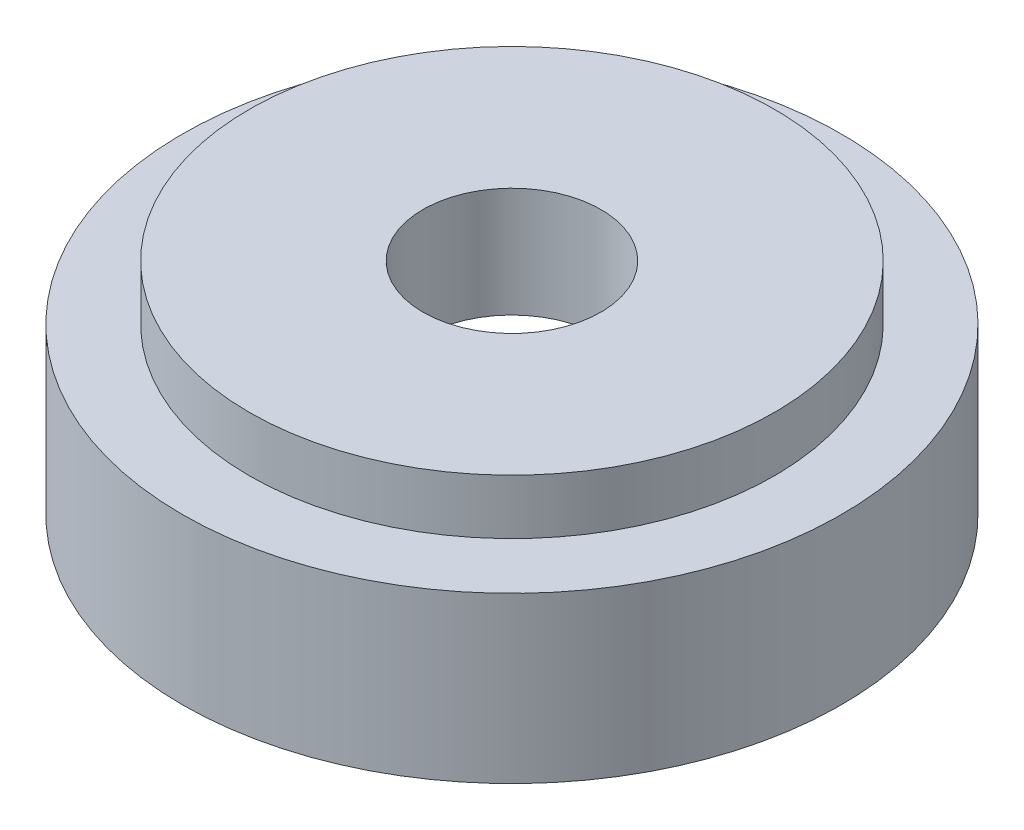
ISO-10303-21;
HEADER;
FILE_DESCRIPTION(('STEP AP214'),'2;1');
FILE_NAME('part.step','',(''),(''),'','','');
FILE_SCHEMA(('AUTOMOTIVE_DESIGN { 1 0 10303 214 1 1 1 1 }'));
ENDSEC;
DATA;
#1=APPLICATION_CONTEXT('core data for automotive mechanical design processes');
#2=APPLICATION_PROTOCOL_DEFINITION('international standard','automotive_design',2000,#1);
#3=PRODUCT_CONTEXT('',#1,'mechanical');
#4=PRODUCT('Part','Part','',(#3));
#5=PRODUCT_RELATED_PRODUCT_CATEGORY('part','',(#4));
#6=PRODUCT_DEFINITION_FORMATION('','',#4);
#7=PRODUCT_DEFINITION_CONTEXT('part definition',#1,'design');
#8=PRODUCT_DEFINITION('design','',#6,#7);
#9=PRODUCT_DEFINITION_SHAPE('','',#8);
#10=(LENGTH_UNIT() NAMED_UNIT(*) SI_UNIT(.MILLI.,.METRE.));
#11=(NAMED_UNIT(*) PLANE_ANGLE_UNIT() SI_UNIT($,.RADIAN.));
#12=(NAMED_UNIT(*) SI_UNIT($,.STERADIAN.) SOLID_ANGLE_UNIT());
#13=UNCERTAINTY_MEASURE_WITH_UNIT(LENGTH_MEASURE(1.E-05),#10,'distance_accuracy_value','');
#14=(GEOMETRIC_REPRESENTATION_CONTEXT(3) GLOBAL_UNCERTAINTY_ASSIGNED_CONTEXT((#13)) GLOBAL_UNIT_ASSIGNED_CONTEXT((#10,
#11,#12)) REPRESENTATION_CONTEXT('',''));
#15=CARTESIAN_POINT('',(0.,0.,0.));
#16=DIRECTION('',(0.,0.,1.));
#17=DIRECTION('',(1.,0.,0.));
#18=AXIS2_PLACEMENT_3D('',#15,#16,#17);
#19=CARTESIAN_POINT('',(0.,-5.,0.));
#20=DIRECTION('',(0.,1.,0.));
#21=DIRECTION('',(0.,0.,1.));
#22=AXIS2_PLACEMENT_3D('',#19,#20,#21);
#23=PLANE('',#22);
#24=CARTESIAN_POINT('',(0.,-5.,0.));
#25=DIRECTION('',(0.,1.,0.));
#26=DIRECTION('',(0.,0.,1.));
#27=AXIS2_PLACEMENT_3D('',#24,#25,#26);
#28=CIRCLE('',#27,8.1);
#29=CARTESIAN_POINT('',(0.,-5.,8.1));
#30=VERTEX_POINT('',#29);
#31=EDGE_CURVE('E59',#30,#30,#28,.T.);
#32=ORIENTED_EDGE('',*,*,#31,.T.);
#33=EDGE_LOOP('',(#32));
#34=FACE_BOUND('',#33,.T.);
#35=CARTESIAN_POINT('',(0.,-5.,0.));
#36=DIRECTION('',(0.,1.,0.));
#37=DIRECTION('',(0.,0.,1.));
#38=AXIS2_PLACEMENT_3D('',#35,#36,#37);
#39=CIRCLE('',#38,23.9);
#40=CARTESIAN_POINT('',(0.,-5.,23.9));
#41=VERTEX_POINT('',#40);
#42=EDGE_CURVE('E10',#41,#41,#39,.T.);
#43=ORIENTED_EDGE('',*,*,#42,.F.);
#44=EDGE_LOOP('',(#43));
#45=FACE_BOUND('',#44,.T.);
#46=ADVANCED_FACE('F41',(#34,#45),#23,.F.);
#47=CARTESIAN_POINT('',(0.,5.,0.));
#48=DIRECTION('',(0.,-1.,0.));
#49=DIRECTION('',(0.,0.,-1.));
#50=AXIS2_PLACEMENT_3D('',#47,#48,#49);
#51=CYLINDRICAL_SURFACE('',#50,8.1);
#52=CARTESIAN_POINT('',(0.,5.,0.));
#53=DIRECTION('',(0.,1.,0.));
#54=DIRECTION('',(0.,0.,1.));
#55=AXIS2_PLACEMENT_3D('',#52,#53,#54);
#56=CIRCLE('',#55,8.1);
#57=CARTESIAN_POINT('',(0.,5.,8.1));
#58=VERTEX_POINT('',#57);
#59=EDGE_CURVE('E54',#58,#58,#56,.T.);
#60=ORIENTED_EDGE('',*,*,#59,.T.);
#61=EDGE_LOOP('',(#60));
#62=FACE_BOUND('',#61,.T.);
#63=ORIENTED_EDGE('',*,*,#31,.F.);
#64=EDGE_LOOP('',(#63));
#65=FACE_BOUND('',#64,.T.);
#66=ADVANCED_FACE('F43',(#62,#65),#51,.F.);
#67=CARTESIAN_POINT('',(0.,5.,0.));
#68=DIRECTION('',(0.,-1.,0.));
#69=DIRECTION('',(0.,0.,-1.));
#70=AXIS2_PLACEMENT_3D('',#67,#68,#69);
#71=CYLINDRICAL_SURFACE('',#70,23.9);
#72=CARTESIAN_POINT('',(0.,5.,0.));
#73=DIRECTION('',(0.,1.,0.));
#74=DIRECTION('',(0.,0.,1.));
#75=AXIS2_PLACEMENT_3D('',#72,#73,#74);
#76=CIRCLE('',#75,23.9);
#77=CARTESIAN_POINT('',(0.,5.,23.9));
#78=VERTEX_POINT('',#77);
#79=EDGE_CURVE('E49',#78,#78,#76,.T.);
#80=ORIENTED_EDGE('',*,*,#79,.F.);
#81=EDGE_LOOP('',(#80));
#82=FACE_BOUND('',#81,.T.);
#83=CARTESIAN_POINT('',(0.,0.,0.));
#84=DIRECTION('',(0.,1.,0.));
#85=DIRECTION('',(0.,0.,1.));
#86=AXIS2_PLACEMENT_3D('',#83,#84,#85);
#87=CIRCLE('',#86,23.9);
#88=CARTESIAN_POINT('',(0.,0.,23.9));
#89=VERTEX_POINT('',#88);
#90=EDGE_CURVE('E45',#89,#89,#87,.T.);
#91=ORIENTED_EDGE('',*,*,#90,.T.);
#92=EDGE_LOOP('',(#91));
#93=FACE_BOUND('',#92,.T.);
#94=ADVANCED_FACE('F71',(#82,#93),#71,.T.);
#95=CARTESIAN_POINT('',(0.,5.,0.));
#96=DIRECTION('',(0.,1.,0.));
#97=DIRECTION('',(0.,0.,1.));
#98=AXIS2_PLACEMENT_3D('',#95,#96,#97);
#99=PLANE('',#98);
#100=ORIENTED_EDGE('',*,*,#59,.F.);
#101=EDGE_LOOP('',(#100));
#102=FACE_BOUND('',#101,.T.);
#103=ORIENTED_EDGE('',*,*,#79,.T.);
#104=EDGE_LOOP('',(#103));
#105=FACE_BOUND('',#104,.T.);
#106=ADVANCED_FACE('F83',(#102,#105),#99,.T.);
#107=CARTESIAN_POINT('',(0.,-5.,0.));
#108=DIRECTION('',(0.,1.,0.));
#109=DIRECTION('',(0.,0.,1.));
#110=AXIS2_PLACEMENT_3D('',#107,#108,#109);
#111=CYLINDRICAL_SURFACE('',#110,30.);
#112=CARTESIAN_POINT('',(0.,0.,0.));
#113=DIRECTION('',(0.,1.,0.));
#114=DIRECTION('',(0.,0.,1.));
#115=AXIS2_PLACEMENT_3D('',#112,#113,#114);
#116=CIRCLE('',#115,30.);
#117=CARTESIAN_POINT('',(0.,0.,30.));
#118=VERTEX_POINT('',#117);
#119=EDGE_CURVE('E62',#118,#118,#116,.T.);
#120=ORIENTED_EDGE('',*,*,#119,.F.);
#121=EDGE_LOOP('',(#120));
#122=FACE_BOUND('',#121,.T.);
#123=CARTESIAN_POINT('',(0.,-15.,0.));
#124=DIRECTION('',(0.,1.,0.));
#125=DIRECTION('',(0.,0.,1.));
#126=AXIS2_PLACEMENT_3D('',#123,#124,#125);
#127=CIRCLE('',#126,30.);
#128=CARTESIAN_POINT('',(0.,-15.,30.));
#129=VERTEX_POINT('',#128);
#130=EDGE_CURVE('E57',#129,#129,#127,.T.);
#131=ORIENTED_EDGE('',*,*,#130,.T.);
#132=EDGE_LOOP('',(#131));
#133=FACE_BOUND('',#132,.T.);
#134=ADVANCED_FACE('F77',(#122,#133),#111,.T.);
#135=CARTESIAN_POINT('',(0.,0.,0.));
#136=DIRECTION('',(0.,1.,0.));
#137=DIRECTION('',(0.,0.,1.));
#138=AXIS2_PLACEMENT_3D('',#135,#136,#137);
#139=PLANE('',#138);
#140=ORIENTED_EDGE('',*,*,#90,.F.);
#141=EDGE_LOOP('',(#140));
#142=FACE_BOUND('',#141,.T.);
#143=ORIENTED_EDGE('',*,*,#119,.T.);
#144=EDGE_LOOP('',(#143));
#145=FACE_BOUND('',#144,.T.);
#146=ADVANCED_FACE('F73',(#142,#145),#139,.T.);
#147=CARTESIAN_POINT('',(0.,-15.,0.));
#148=DIRECTION('',(0.,1.,0.));
#149=DIRECTION('',(0.,0.,1.));
#150=AXIS2_PLACEMENT_3D('',#147,#148,#149);
#151=CYLINDRICAL_SURFACE('',#150,23.9);
#152=CARTESIAN_POINT('',(0.,-15.,0.));
#153=DIRECTION('',(0.,1.,0.));
#154=DIRECTION('',(0.,0.,1.));
#155=AXIS2_PLACEMENT_3D('',#152,#153,#154);
#156=CIRCLE('',#155,23.9);
#157=CARTESIAN_POINT('',(0.,-15.,23.9));
#158=VERTEX_POINT('',#157);
#159=EDGE_CURVE('E88',#158,#158,#156,.T.);
#160=ORIENTED_EDGE('',*,*,#159,.F.);
#161=EDGE_LOOP('',(#160));
#162=FACE_BOUND('',#161,.T.);
#163=ORIENTED_EDGE('',*,*,#42,.T.);
#164=EDGE_LOOP('',(#163));
#165=FACE_BOUND('',#164,.T.);
#166=ADVANCED_FACE('F76',(#162,#165),#151,.F.);
#167=CARTESIAN_POINT('',(0.,-15.,0.));
#168=DIRECTION('',(0.,1.,0.));
#169=DIRECTION('',(0.,0.,1.));
#170=AXIS2_PLACEMENT_3D('',#167,#168,#169);
#171=PLANE('',#170);
#172=ORIENTED_EDGE('',*,*,#159,.T.);
#173=EDGE_LOOP('',(#172));
#174=FACE_BOUND('',#173,.T.);
#175=ORIENTED_EDGE('',*,*,#130,.F.);
#176=EDGE_LOOP('',(#175));
#177=FACE_BOUND('',#176,.T.);
#178=ADVANCED_FACE('F92',(#174,#177),#171,.F.);
#179=CLOSED_SHELL('',(#46,#66,#94,#106,#134,#146,#166,#178));
#180=MANIFOLD_SOLID_BREP('B2',#179);
#181=ADVANCED_BREP_SHAPE_REPRESENTATION('',(#18,#180),#14);
#182=SHAPE_DEFINITION_REPRESENTATION(#9,#181);
ENDSEC;
END-ISO-10303-21;
